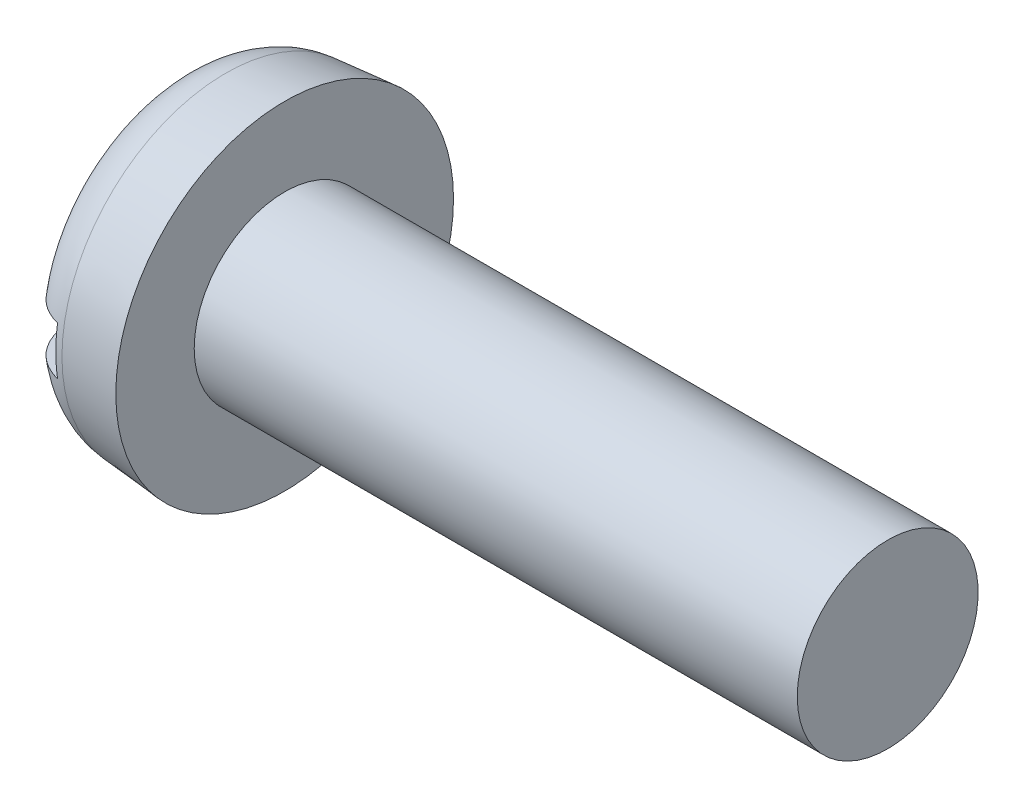
ISO-10303-21;
HEADER;
FILE_DESCRIPTION(('STEP AP214'),'2;1');
FILE_NAME('part.step','',(''),(''),'','','');
FILE_SCHEMA(('AUTOMOTIVE_DESIGN { 1 0 10303 214 1 1 1 1 }'));
ENDSEC;
DATA;
#1=APPLICATION_CONTEXT('core data for automotive mechanical design processes');
#2=APPLICATION_PROTOCOL_DEFINITION('international standard','automotive_design',2000,#1);
#3=PRODUCT_CONTEXT('',#1,'mechanical');
#4=PRODUCT('Part','Part','',(#3));
#5=PRODUCT_RELATED_PRODUCT_CATEGORY('part','',(#4));
#6=PRODUCT_DEFINITION_FORMATION('','',#4);
#7=PRODUCT_DEFINITION_CONTEXT('part definition',#1,'design');
#8=PRODUCT_DEFINITION('design','',#6,#7);
#9=PRODUCT_DEFINITION_SHAPE('','',#8);
#10=(LENGTH_UNIT() NAMED_UNIT(*) SI_UNIT(.MILLI.,.METRE.));
#11=(NAMED_UNIT(*) PLANE_ANGLE_UNIT() SI_UNIT($,.RADIAN.));
#12=(NAMED_UNIT(*) SI_UNIT($,.STERADIAN.) SOLID_ANGLE_UNIT());
#13=UNCERTAINTY_MEASURE_WITH_UNIT(LENGTH_MEASURE(1.E-05),#10,'distance_accuracy_value','');
#14=(GEOMETRIC_REPRESENTATION_CONTEXT(3) GLOBAL_UNCERTAINTY_ASSIGNED_CONTEXT((#13)) GLOBAL_UNIT_ASSIGNED_CONTEXT((#10,
#11,#12)) REPRESENTATION_CONTEXT('',''));
#15=CARTESIAN_POINT('',(0.,0.,0.));
#16=DIRECTION('',(0.,0.,1.));
#17=DIRECTION('',(1.,0.,0.));
#18=AXIS2_PLACEMENT_3D('',#15,#16,#17);
#19=CARTESIAN_POINT('',(0.,0.,0.));
#20=DIRECTION('',(-1.,0.,0.));
#21=DIRECTION('',(0.,0.,1.));
#22=AXIS2_PLACEMENT_3D('',#19,#20,#21);
#23=PLANE('',#22);
#24=DIRECTION('',(0.,0.,-1.));
#25=VECTOR('',#24,1.);
#26=CARTESIAN_POINT('',(0.,0.399999999999999,2.8));
#27=LINE('',#26,#25);
#28=CARTESIAN_POINT('',(0.,0.399999999999999,1.77326763142532));
#29=VERTEX_POINT('',#28);
#30=CARTESIAN_POINT('',(0.,0.399999999999999,-1.77326763142532));
#31=VERTEX_POINT('',#30);
#32=EDGE_CURVE('E85',#29,#31,#27,.T.);
#33=ORIENTED_EDGE('',*,*,#32,.F.);
#34=CARTESIAN_POINT('',(0.,0.,0.));
#35=DIRECTION('',(-1.,0.,0.));
#36=DIRECTION('',(0.,0.,1.));
#37=AXIS2_PLACEMENT_3D('',#34,#35,#36);
#38=CIRCLE('',#37,1.81782234903766);
#39=EDGE_CURVE('E91',#29,#31,#38,.T.);
#40=ORIENTED_EDGE('',*,*,#39,.T.);
#41=EDGE_LOOP('',(#33,#40));
#42=FACE_BOUND('',#41,.T.);
#43=ADVANCED_FACE('F32',(#42),#23,.T.);
#44=CARTESIAN_POINT('',(-25.4,0.,0.));
#45=DIRECTION('',(-1.,0.,0.));
#46=DIRECTION('',(0.,0.,1.));
#47=AXIS2_PLACEMENT_3D('',#44,#45,#46);
#48=CYLINDRICAL_SURFACE('',#47,1.5);
#49=CARTESIAN_POINT('',(11.8,0.,0.));
#50=DIRECTION('',(-1.,0.,0.));
#51=DIRECTION('',(0.,0.,1.));
#52=AXIS2_PLACEMENT_3D('',#49,#50,#51);
#53=CIRCLE('',#52,1.5);
#54=CARTESIAN_POINT('',(11.8,0.,1.5));
#55=VERTEX_POINT('',#54);
#56=EDGE_CURVE('E92',#55,#55,#53,.T.);
#57=ORIENTED_EDGE('',*,*,#56,.T.);
#58=EDGE_LOOP('',(#57));
#59=FACE_BOUND('',#58,.T.);
#60=CARTESIAN_POINT('',(1.8,0.,0.));
#61=DIRECTION('',(-1.,0.,0.));
#62=DIRECTION('',(0.,0.,1.));
#63=AXIS2_PLACEMENT_3D('',#60,#61,#62);
#64=CIRCLE('',#63,1.5);
#65=CARTESIAN_POINT('',(1.8,0.,1.5));
#66=VERTEX_POINT('',#65);
#67=EDGE_CURVE('E149',#66,#66,#64,.T.);
#68=ORIENTED_EDGE('',*,*,#67,.F.);
#69=EDGE_LOOP('',(#68));
#70=FACE_BOUND('',#69,.T.);
#71=ADVANCED_FACE('F137',(#59,#70),#48,.T.);
#72=CARTESIAN_POINT('',(11.8,1.5,0.));
#73=DIRECTION('',(1.,0.,0.));
#74=DIRECTION('',(0.,0.,-1.));
#75=AXIS2_PLACEMENT_3D('',#72,#73,#74);
#76=PLANE('',#75);
#77=ORIENTED_EDGE('',*,*,#56,.F.);
#78=EDGE_LOOP('',(#77));
#79=FACE_BOUND('',#78,.T.);
#80=ADVANCED_FACE('F135',(#79),#76,.T.);
#81=DIRECTION('',(0.,0.,1.));
#82=VECTOR('',#81,1.);
#83=CARTESIAN_POINT('',(0.,-0.4,-2.8));
#84=LINE('',#83,#82);
#85=CARTESIAN_POINT('',(0.,-0.4,-1.77326763142532));
#86=VERTEX_POINT('',#85);
#87=CARTESIAN_POINT('',(0.,-0.4,1.77326763142532));
#88=VERTEX_POINT('',#87);
#89=EDGE_CURVE('E76',#86,#88,#84,.T.);
#90=ORIENTED_EDGE('',*,*,#89,.F.);
#91=EDGE_CURVE('E83',#86,#88,#38,.T.);
#92=ORIENTED_EDGE('',*,*,#91,.T.);
#93=EDGE_LOOP('',(#90,#92));
#94=FACE_BOUND('',#93,.T.);
#95=ADVANCED_FACE('F82',(#94),#23,.T.);
#96=CARTESIAN_POINT('',(0.,0.,0.));
#97=DIRECTION('',(1.,0.,0.));
#98=DIRECTION('',(0.,0.,-1.));
#99=AXIS2_PLACEMENT_3D('',#96,#97,#98);
#100=CONICAL_SURFACE('',#99,2.64252040565334,0.087266462599717);
#101=CARTESIAN_POINT('',(0.821559831527107,0.,0.));
#102=DIRECTION('',(-1.,0.,0.));
#103=DIRECTION('',(0.,0.,1.));
#104=AXIS2_PLACEMENT_3D('',#101,#102,#103);
#105=CIRCLE('',#104,2.71439757732023);
#106=CARTESIAN_POINT('',(0.821559831527107,0.,2.71439757732023));
#107=VERTEX_POINT('',#106);
#108=EDGE_CURVE('E95',#107,#107,#105,.F.);
#109=ORIENTED_EDGE('',*,*,#108,.T.);
#110=EDGE_LOOP('',(#109));
#111=FACE_BOUND('',#110,.T.);
#112=CARTESIAN_POINT('',(1.8,0.,0.));
#113=DIRECTION('',(-1.,0.,0.));
#114=DIRECTION('',(0.,0.,1.));
#115=AXIS2_PLACEMENT_3D('',#112,#113,#114);
#116=CIRCLE('',#115,2.8);
#117=CARTESIAN_POINT('',(1.8,0.,2.8));
#118=VERTEX_POINT('',#117);
#119=EDGE_CURVE('E97',#118,#118,#116,.T.);
#120=ORIENTED_EDGE('',*,*,#119,.T.);
#121=EDGE_LOOP('',(#120));
#122=FACE_BOUND('',#121,.T.);
#123=ADVANCED_FACE('F128',(#111,#122),#100,.T.);
#124=CARTESIAN_POINT('',(1.8,1.5,0.));
#125=DIRECTION('',(-1.,0.,0.));
#126=DIRECTION('',(0.,0.,1.));
#127=AXIS2_PLACEMENT_3D('',#124,#125,#126);
#128=PLANE('',#127);
#129=ORIENTED_EDGE('',*,*,#119,.F.);
#130=EDGE_LOOP('',(#129));
#131=FACE_BOUND('',#130,.T.);
#132=ORIENTED_EDGE('',*,*,#67,.T.);
#133=EDGE_LOOP('',(#132));
#134=FACE_BOUND('',#133,.T.);
#135=ADVANCED_FACE('F124',(#131,#134),#128,.F.);
#136=CARTESIAN_POINT('',(0.9,0.,0.));
#137=DIRECTION('',(-1.,0.,0.));
#138=DIRECTION('',(0.,0.,1.));
#139=AXIS2_PLACEMENT_3D('',#136,#137,#138);
#140=TOROIDAL_SURFACE('',#139,1.81782234903766,0.9);
#141=CARTESIAN_POINT('',(0.285780762477817,0.399999999999999,-2.44311963508101));
#142=CARTESIAN_POINT('',(0.322325244969282,0.399999999999999,-2.47769297217772));
#143=CARTESIAN_POINT('',(0.361794878156767,0.399999999999999,-2.50922544126929));
#144=CARTESIAN_POINT('',(0.445493757535042,0.399999999999999,-2.56525291577746));
#145=CARTESIAN_POINT('',(0.48972822484029,0.399999999999999,-2.58974009118149));
#146=CARTESIAN_POINT('',(0.581685294636184,0.399999999999999,-2.63091846199156));
#147=CARTESIAN_POINT('',(0.629407305379897,0.399999999999999,-2.64761097641683));
#148=CARTESIAN_POINT('',(0.726972312257168,0.399999999999999,-2.67270033258514));
#149=CARTESIAN_POINT('',(0.776814803129367,0.399999999999999,-2.68109913910669));
#150=CARTESIAN_POINT('',(0.876977038697278,0.399999999999999,-2.68933922206438));
#151=CARTESIAN_POINT('',(0.92729364560996,0.399999999999999,-2.68921866149007));
#152=CARTESIAN_POINT('',(1.02719093347253,0.399999999999999,-2.68051830929739));
#153=CARTESIAN_POINT('',(1.07677160162593,0.399999999999999,-2.67193837076201));
#154=CARTESIAN_POINT('',(1.17371760664879,0.399999999999999,-2.6465919807109));
#155=CARTESIAN_POINT('',(1.2210859954371,0.399999999999999,-2.62983719558013));
#156=CARTESIAN_POINT('',(1.31235127069059,0.399999999999999,-2.58864040768255));
#157=CARTESIAN_POINT('',(1.35624813968071,0.399999999999999,-2.56419836622246));
#158=CARTESIAN_POINT('',(1.43950339303332,0.399999999999999,-2.50824069345436));
#159=CARTESIAN_POINT('',(1.47884484993389,0.399999999999999,-2.47669988555644));
#160=CARTESIAN_POINT('',(1.55173067508121,0.399999999999999,-2.40751412200212));
#161=CARTESIAN_POINT('',(1.5852748745774,0.399999999999999,-2.36986898871862));
#162=CARTESIAN_POINT('',(1.64594872274809,0.399999999999999,-2.28919528368316));
#163=CARTESIAN_POINT('',(1.67301846569636,0.399999999999999,-2.24612167422176));
#164=CARTESIAN_POINT('',(1.71966197411636,0.399999999999999,-2.15609376898817));
#165=CARTESIAN_POINT('',(1.73923530584546,0.399999999999999,-2.10913924885738));
#166=CARTESIAN_POINT('',(1.77066025907209,0.399999999999999,-2.01194193646076));
#167=CARTESIAN_POINT('',(1.78239254664628,0.399999999999999,-1.96166058810882));
#168=CARTESIAN_POINT('',(1.7974373595853,0.399999999999999,-1.85985639013623));
#169=CARTESIAN_POINT('',(1.80074908437145,0.399999999999999,-1.80833342293966));
#170=CARTESIAN_POINT('',(1.79894832980293,0.399999999999999,-1.70434405475568));
#171=CARTESIAN_POINT('',(1.79365584590562,0.399999999999999,-1.651880798299));
#172=CARTESIAN_POINT('',(1.77456092354076,0.399999999999999,-1.54852841034414));
#173=CARTESIAN_POINT('',(1.76075741543224,0.399999999999999,-1.49763947754675));
#174=CARTESIAN_POINT('',(1.7246504916629,0.399999999999999,-1.3975266769579));
#175=CARTESIAN_POINT('',(1.70214283236717,0.399999999999999,-1.34837644263265));
#176=CARTESIAN_POINT('',(1.64933120824444,0.399999999999999,-1.25444995564252));
#177=CARTESIAN_POINT('',(1.6190255468442,0.399999999999999,-1.20967465773975));
#178=CARTESIAN_POINT('',(1.55085214424215,0.399999999999999,-1.12504927254803));
#179=CARTESIAN_POINT('',(1.51286662510254,0.399999999999999,-1.08529386793689));
#180=CARTESIAN_POINT('',(1.4306134165613,0.399999999999999,-1.01288372669285));
#181=CARTESIAN_POINT('',(1.38634513970435,0.399999999999999,-0.980229654778111));
#182=CARTESIAN_POINT('',(1.29378824575784,0.399999999999999,-0.924048107397016));
#183=CARTESIAN_POINT('',(1.24562231583718,0.399999999999999,-0.900319541839471));
#184=CARTESIAN_POINT('',(1.14574424072186,0.399999999999999,-0.862177327128566));
#185=CARTESIAN_POINT('',(1.09403573066562,0.399999999999999,-0.847754283110135));
#186=CARTESIAN_POINT('',(0.993395643106034,0.399999999999999,-0.830011922353259));
#187=CARTESIAN_POINT('',(0.944615271160062,0.399999999999999,-0.825833796085957));
#188=CARTESIAN_POINT('',(0.847107354416666,0.399999999999999,-0.826334878356685));
#189=CARTESIAN_POINT('',(0.798379798268946,0.399999999999999,-0.831011470142969));
#190=CARTESIAN_POINT('',(0.705495670608723,0.399999999999999,-0.848340731069384));
#191=CARTESIAN_POINT('',(0.661242330843084,0.399999999999999,-0.860484898174224));
#192=CARTESIAN_POINT('',(0.575232402842408,0.399999999999999,-0.891650416332973));
#193=CARTESIAN_POINT('',(0.53347652813922,0.399999999999999,-0.910673721938904));
#194=CARTESIAN_POINT('',(0.451191926076945,0.399999999999999,-0.956010770911779));
#195=CARTESIAN_POINT('',(0.410848958567061,0.399999999999999,-0.982660648611481));
#196=CARTESIAN_POINT('',(0.334722321142852,0.399999999999999,-1.04182188589593));
#197=CARTESIAN_POINT('',(0.298940164912518,0.399999999999999,-1.0743351828853));
#198=CARTESIAN_POINT('',(0.229649980616187,0.399999999999999,-1.14749226888793));
#199=CARTESIAN_POINT('',(0.19663491483028,0.399999999999999,-1.18860403936715));
#200=CARTESIAN_POINT('',(0.137645150810003,0.399999999999999,-1.27560624817727));
#201=CARTESIAN_POINT('',(0.111672172806046,0.399999999999999,-1.32149785033543));
#202=CARTESIAN_POINT('',(0.0665593590158845,0.399999999999999,-1.41881690272049));
#203=CARTESIAN_POINT('',(0.0477401615322295,0.399999999999999,-1.47039354331754));
#204=CARTESIAN_POINT('',(0.0191028447664949,0.399999999999999,-1.57598967955257));
#205=CARTESIAN_POINT('',(0.0092842991143383,0.399999999999999,-1.63000905934828));
#206=CARTESIAN_POINT('',(-0.000908845669418229,0.399999999999999,-1.73850050809585));
#207=CARTESIAN_POINT('',(-0.00135843890630432,0.399999999999999,-1.7929654882335));
#208=CARTESIAN_POINT('',(0.00713794868793661,0.399999999999999,-1.90117587148683));
#209=CARTESIAN_POINT('',(0.0160852351491477,0.399999999999999,-1.9549211735574));
#210=CARTESIAN_POINT('',(0.0428869469078851,0.399999999999999,-2.05874477252473));
#211=CARTESIAN_POINT('',(0.0605196216319729,0.399999999999999,-2.10888044427302));
#212=CARTESIAN_POINT('',(0.104140493725079,0.399999999999999,-2.20532358851202));
#213=CARTESIAN_POINT('',(0.130117020588857,0.399999999999999,-2.25163629510255));
#214=CARTESIAN_POINT('',(0.178150945787741,0.399999999999999,-2.32211375046635));
#215=CARTESIAN_POINT('',(0.197843641859489,0.399999999999999,-2.34792122195273));
#216=CARTESIAN_POINT('',(0.239879292580621,0.399999999999999,-2.39728022756983));
#217=CARTESIAN_POINT('',(0.26222221206527,0.399999999999999,-2.42083179162577));
#218=CARTESIAN_POINT('',(0.285780762477817,0.399999999999999,-2.44311963508101));
#219=B_SPLINE_CURVE_WITH_KNOTS('',3,(#141,#142,#143,#144,#145,#146,#147,#148,#149,#150,#151,
#152,#153,#154,#155,#156,#157,#158,#159,#160,#161,#162,#163,#164,#165,#166,#167,#168,#169,#170,
#171,#172,#173,#174,#175,#176,#177,#178,#179,#180,#181,#182,#183,#184,#185,#186,#187,#188,#189,
#190,#191,#192,#193,#194,#195,#196,#197,#198,#199,#200,#201,#202,#203,#204,#205,#206,#207,#208,
#209,#210,#211,#212,#213,#214,#215,#216,#217,#218),.UNSPECIFIED.,.T.,.F.,(4,2,2,2,2,2,2,2,2,2,2,
2,2,2,2,2,2,2,2,2,2,2,2,2,2,2,2,2,2,2,2,2,2,2,2,2,2,2,4),(0.,0.15080428220943,0.301775523831159,
0.452721208703323,0.603631125974155,0.753865076726384,0.904101636690626,1.05412441728995,
1.2041479530309,1.35471219197995,1.50528081291863,1.65719291262943,1.80911380065295,
1.96329712022902,2.11749509812026,2.27496068670365,2.43244606914274,2.59387611122166,
2.75534130458713,2.9195015653164,3.08367718561128,3.24389389244898,3.40394859014677,
3.55004213794101,3.69609251881818,3.83315592967566,3.97025831464733,4.11470991133513,
4.25920932580005,4.41668805635775,4.57420522099047,4.73812462607052,4.90203626571949,
5.06463536051201,5.22725705028985,5.38592661841767,5.54437521558828,5.64159310397338,
5.73880970255809),.UNSPECIFIED.);
#220=CARTESIAN_POINT('',(0.7,0.399999999999999,-2.66547244738019));
#221=VERTEX_POINT('',#220);
#222=EDGE_CURVE('E11',#31,#221,#219,.T.);
#223=ORIENTED_EDGE('',*,*,#222,.F.);
#224=ORIENTED_EDGE('',*,*,#39,.F.);
#225=CARTESIAN_POINT('',(0.356169071138296,0.399999999999999,1.02545886384317));
#226=CARTESIAN_POINT('',(0.394477383289829,0.399999999999999,0.994276095963573));
#227=CARTESIAN_POINT('',(0.435252098816795,0.399999999999999,0.966090537778846));
#228=CARTESIAN_POINT('',(0.520874070068605,0.399999999999999,0.916713010685472));
#229=CARTESIAN_POINT('',(0.56572297498939,0.399999999999999,0.895523890103122));
#230=CARTESIAN_POINT('',(0.658585145836014,0.399999999999999,0.861072215462475));
#231=CARTESIAN_POINT('',(0.706609437889925,0.399999999999999,0.84783908573147));
#232=CARTESIAN_POINT('',(0.80424325350734,0.399999999999999,0.83024223356215));
#233=CARTESIAN_POINT('',(0.853851628876229,0.399999999999999,0.825872228699233));
#234=CARTESIAN_POINT('',(0.950010182321422,0.399999999999999,0.826277197704913));
#235=CARTESIAN_POINT('',(0.99656347412262,0.399999999999999,0.830513937244102));
#236=CARTESIAN_POINT('',(1.08828168676608,0.399999999999999,0.846797595491545));
#237=CARTESIAN_POINT('',(1.1334463088223,0.399999999999999,0.858846182848628));
#238=CARTESIAN_POINT('',(1.22099947575276,0.399999999999999,0.890027753500388));
#239=CARTESIAN_POINT('',(1.26339999097867,0.399999999999999,0.909127417221132));
#240=CARTESIAN_POINT('',(1.34475562295769,0.399999999999999,0.953613660794996));
#241=CARTESIAN_POINT('',(1.38370973618203,0.399999999999999,0.979002063689565));
#242=CARTESIAN_POINT('',(1.4606297229717,0.399999999999999,1.03768873851847));
#243=CARTESIAN_POINT('',(1.49821861120609,0.399999999999999,1.07148126912978));
#244=CARTESIAN_POINT('',(1.56766557552966,0.399999999999999,1.14451739265722));
#245=CARTESIAN_POINT('',(1.59952174981566,0.399999999999999,1.18376278691406));
#246=CARTESIAN_POINT('',(1.65882951195037,0.399999999999999,1.26965174466254));
#247=CARTESIAN_POINT('',(1.68580874421987,0.399999999999999,1.3166225459502));
#248=CARTESIAN_POINT('',(1.7316261790846,0.399999999999999,1.41438438512647));
#249=CARTESIAN_POINT('',(1.7504634598458,0.399999999999999,1.46517585482832));
#250=CARTESIAN_POINT('',(1.77959171793735,0.399999999999999,1.56990546726));
#251=CARTESIAN_POINT('',(1.78976336496765,0.399999999999999,1.62387693551388));
#252=CARTESIAN_POINT('',(1.80070617985939,0.399999999999999,1.73276786407042));
#253=CARTESIAN_POINT('',(1.80147810121521,0.399999999999999,1.78768724803349));
#254=CARTESIAN_POINT('',(1.7935515731225,0.399999999999999,1.89576039323533));
#255=CARTESIAN_POINT('',(1.78503812714098,0.399999999999999,1.94892767588158));
#256=CARTESIAN_POINT('',(1.75897009134329,0.399999999999999,2.05299963181349));
#257=CARTESIAN_POINT('',(1.74141670948687,0.399999999999999,2.10390460641263));
#258=CARTESIAN_POINT('',(1.69825810143573,0.399999999999999,2.20064023444731));
#259=CARTESIAN_POINT('',(1.67286703477487,0.399999999999999,2.24656646381803));
#260=CARTESIAN_POINT('',(1.61458416704904,0.399999999999999,2.33338474929434));
#261=CARTESIAN_POINT('',(1.58169323312494,0.399999999999999,2.37427738654701));
#262=CARTESIAN_POINT('',(1.51007060998367,0.399999999999999,2.44900649357427));
#263=CARTESIAN_POINT('',(1.47146964140907,0.399999999999999,2.48296829636122));
#264=CARTESIAN_POINT('',(1.38904817001727,0.399999999999999,2.54382334084698));
#265=CARTESIAN_POINT('',(1.34522808158393,0.399999999999999,2.57071714318276));
#266=CARTESIAN_POINT('',(1.25424836231413,0.399999999999999,2.61630908807752));
#267=CARTESIAN_POINT('',(1.20714119293126,0.399999999999999,2.63511196373395));
#268=CARTESIAN_POINT('',(1.11042474691739,0.399999999999999,2.66447616047847));
#269=CARTESIAN_POINT('',(1.06081558875378,0.399999999999999,2.67503787139057));
#270=CARTESIAN_POINT('',(0.960893961973373,0.399999999999999,2.68755622717405));
#271=CARTESIAN_POINT('',(0.910589316471373,0.399999999999999,2.68957539390776));
#272=CARTESIAN_POINT('',(0.810358152757913,0.399999999999999,2.68512046084422));
#273=CARTESIAN_POINT('',(0.760431626986743,0.399999999999999,2.67864653130185));
#274=CARTESIAN_POINT('',(0.662478823238217,0.399999999999999,2.65741995217084));
#275=CARTESIAN_POINT('',(0.614448868329621,0.399999999999999,2.64268425826029));
#276=CARTESIAN_POINT('',(0.521534433162197,0.399999999999999,2.60538142887937));
#277=CARTESIAN_POINT('',(0.476649962619439,0.399999999999999,2.58281426921971));
#278=CARTESIAN_POINT('',(0.391148993047609,0.399999999999999,2.53043182461717));
#279=CARTESIAN_POINT('',(0.350545548527357,0.399999999999999,2.50059523892845));
#280=CARTESIAN_POINT('',(0.274874117650141,0.399999999999999,2.43457977439371));
#281=CARTESIAN_POINT('',(0.239806285839746,0.399999999999999,2.39840071853429));
#282=CARTESIAN_POINT('',(0.1758792791862,0.399999999999999,2.32042102737606));
#283=CARTESIAN_POINT('',(0.147073507775005,0.399999999999999,2.27857662814835));
#284=CARTESIAN_POINT('',(0.0967847753411475,0.399999999999999,2.19069995841567));
#285=CARTESIAN_POINT('',(0.07530224160311,0.399999999999999,2.14466744374764));
#286=CARTESIAN_POINT('',(0.0399276675747797,0.399999999999999,2.04903409979779));
#287=CARTESIAN_POINT('',(0.0261471165350435,0.399999999999999,1.99939205575588));
#288=CARTESIAN_POINT('',(0.00693602242391585,0.399999999999999,1.89852251200784));
#289=CARTESIAN_POINT('',(0.00150590448368245,0.399999999999999,1.84729493171548));
#290=CARTESIAN_POINT('',(-0.000985777473936878,0.399999999999999,1.74359522844075));
#291=CARTESIAN_POINT('',(0.0021251999996528,0.399999999999999,1.69111899279254));
#292=CARTESIAN_POINT('',(0.0168916821616579,0.399999999999999,1.58737297380086));
#293=CARTESIAN_POINT('',(0.0285499964789278,0.399999999999999,1.53610359288829));
#294=CARTESIAN_POINT('',(0.0604020950384819,0.399999999999999,1.43486374575567));
#295=CARTESIAN_POINT('',(0.080804315905155,0.399999999999999,1.38495893538538));
#296=CARTESIAN_POINT('',(0.129530825890043,0.399999999999999,1.28921347783136));
#297=CARTESIAN_POINT('',(0.157849403934621,0.399999999999999,1.24336993202389));
#298=CARTESIAN_POINT('',(0.213684916145749,0.399999999999999,1.16773658539622));
#299=CARTESIAN_POINT('',(0.239651023875377,0.399999999999999,1.13678903007943));
#300=CARTESIAN_POINT('',(0.29525297901351,0.399999999999999,1.07838116842152));
#301=CARTESIAN_POINT('',(0.324888803246328,0.399999999999999,1.05092084005941));
#302=CARTESIAN_POINT('',(0.356169071138296,0.399999999999999,1.02545886384317));
#303=B_SPLINE_CURVE_WITH_KNOTS('',3,(#225,#226,#227,#228,#229,#230,#231,#232,#233,#234,#235,
#236,#237,#238,#239,#240,#241,#242,#243,#244,#245,#246,#247,#248,#249,#250,#251,#252,#253,#254,
#255,#256,#257,#258,#259,#260,#261,#262,#263,#264,#265,#266,#267,#268,#269,#270,#271,#272,#273,
#274,#275,#276,#277,#278,#279,#280,#281,#282,#283,#284,#285,#286,#287,#288,#289,#290,#291,#292,
#293,#294,#295,#296,#297,#298,#299,#300,#301,#302),.UNSPECIFIED.,.T.,.F.,(4,2,2,2,2,2,2,2,2,2,2,
2,2,2,2,2,2,2,2,2,2,2,2,2,2,2,2,2,2,2,2,2,2,2,2,2,2,2,4),(0.,0.148056677712979,
0.296173556814866,0.444834912477076,0.593390856036848,0.732942639414739,0.87252424155987,
1.01145452751666,1.15042513517956,1.30141738715291,1.45245963818336,1.61420969223844,
1.7759780548859,1.93993961693164,2.10388803551639,2.26462860972824,2.42534771058163,
2.58201478455569,2.73866375372932,2.89216335268838,3.04565077231286,3.19708679229202,
3.34851564860216,3.49883427697698,3.64914989207022,3.79915813668078,3.94916684463061,
4.09962050651671,4.25007836811616,4.40177296660437,4.55347641441351,4.70732244078731,
4.86117629939849,5.0181609530014,5.17519723279955,5.33620557401864,5.49709805791682,
5.61799301592463,5.73888721047272),.UNSPECIFIED.);
#304=CARTESIAN_POINT('',(0.7,0.399999999999999,2.66547244738019));
#305=VERTEX_POINT('',#304);
#306=EDGE_CURVE('E109',#305,#29,#303,.T.);
#307=ORIENTED_EDGE('',*,*,#306,.F.);
#308=CARTESIAN_POINT('',(0.7,0.,0.));
#309=DIRECTION('',(-1.,0.,0.));
#310=DIRECTION('',(0.,0.,1.));
#311=AXIS2_PLACEMENT_3D('',#308,#309,#310);
#312=CIRCLE('',#311,2.69531878777687);
#313=CARTESIAN_POINT('',(0.7,-0.4,2.66547244738019));
#314=VERTEX_POINT('',#313);
#315=EDGE_CURVE('E103',#305,#314,#312,.F.);
#316=ORIENTED_EDGE('',*,*,#315,.T.);
#317=CARTESIAN_POINT('',(0.356169071138295,-0.4,1.02545886384317));
#318=CARTESIAN_POINT('',(0.314031332279046,-0.4,1.05976167261355));
#319=CARTESIAN_POINT('',(0.274819372687131,-0.4,1.0977427449374));
#320=CARTESIAN_POINT('',(0.20326819432942,-0.4,1.17978565669674));
#321=CARTESIAN_POINT('',(0.170942545508555,-0.4,1.22385922524595));
#322=CARTESIAN_POINT('',(0.114111407238762,-0.4,1.31672727393884));
#323=CARTESIAN_POINT('',(0.0895968760226379,-0.4,1.36551620987613));
#324=CARTESIAN_POINT('',(0.0490785202121342,-0.4,1.46648183341045));
#325=CARTESIAN_POINT('',(0.0330703604686471,-0.4,1.51865678013273));
#326=CARTESIAN_POINT('',(0.0100453697545739,-0.4,1.62518908376032));
#327=CARTESIAN_POINT('',(0.00306618218707072,-0.4,1.67955460937645));
#328=CARTESIAN_POINT('',(-0.00144685561490153,-0.4,1.78868546318226));
#329=CARTESIAN_POINT('',(0.00101939609011318,-0.4,1.84345079568049));
#330=CARTESIAN_POINT('',(0.0152891480749748,-0.4,1.95052330416009));
#331=CARTESIAN_POINT('',(0.0268854930795697,-0.4,2.0028580557661));
#332=CARTESIAN_POINT('',(0.0589248901673074,-0.4,2.10474672243029));
#333=CARTESIAN_POINT('',(0.0793666318053631,-0.4,2.15430104818042));
#334=CARTESIAN_POINT('',(0.12795627217374,-0.4,2.24792186385266));
#335=CARTESIAN_POINT('',(0.155901237504733,-0.4,2.29209371256844));
#336=CARTESIAN_POINT('',(0.218944857951456,-0.4,2.37499861286517));
#337=CARTESIAN_POINT('',(0.254042725445854,-0.4,2.41373226246544));
#338=CARTESIAN_POINT('',(0.32966685096813,-0.4,2.48389534278566));
#339=CARTESIAN_POINT('',(0.370077637452012,-0.4,2.51544927894014));
#340=CARTESIAN_POINT('',(0.455677448683675,-0.4,2.57122459505542));
#341=CARTESIAN_POINT('',(0.500866128165061,-0.4,2.59544650436481));
#342=CARTESIAN_POINT('',(0.59413782417454,-0.4,2.6355729416184));
#343=CARTESIAN_POINT('',(0.642178527071038,-0.4,2.65157587103637));
#344=CARTESIAN_POINT('',(0.740273420359947,-0.4,2.67523109383666));
#345=CARTESIAN_POINT('',(0.790327524333046,-0.4,2.68288374523438));
#346=CARTESIAN_POINT('',(0.890686133385994,-0.4,2.68958762962226));
#347=CARTESIAN_POINT('',(0.940986998851127,-0.4,2.68869347246838));
#348=CARTESIAN_POINT('',(1.04072178380744,-0.4,2.67846167879018));
#349=CARTESIAN_POINT('',(1.0901557170213,-0.4,2.66912417603886));
#350=CARTESIAN_POINT('',(1.18669599164727,-0.4,2.64229877559468));
#351=CARTESIAN_POINT('',(1.23380501833184,-0.4,2.6248205362643));
#352=CARTESIAN_POINT('',(1.32443528846507,-0.4,2.58223220159563));
#353=CARTESIAN_POINT('',(1.36795650500275,-0.4,2.5571220490195));
#354=CARTESIAN_POINT('',(1.45036421793263,-0.4,2.49989362614525));
#355=CARTESIAN_POINT('',(1.48923230512215,-0.4,2.46774885590998));
#356=CARTESIAN_POINT('',(1.56107927302393,-0.4,2.39744378923729));
#357=CARTESIAN_POINT('',(1.59405796507024,-0.4,2.35928330016087));
#358=CARTESIAN_POINT('',(1.65352847250663,-0.4,2.2776666814067));
#359=CARTESIAN_POINT('',(1.67995797143492,-0.4,2.23416516156708));
#360=CARTESIAN_POINT('',(1.72526137908633,-0.4,2.14339421504174));
#361=CARTESIAN_POINT('',(1.74413484906926,-0.4,2.09612456975119));
#362=CARTESIAN_POINT('',(1.77411508290512,-0.4,1.9983989612356));
#363=CARTESIAN_POINT('',(1.78509960932637,-0.4,1.9479055243096));
#364=CARTESIAN_POINT('',(1.79862667184961,-0.4,1.84580292273346));
#365=CARTESIAN_POINT('',(1.80116838107033,-0.4,1.79419364929756));
#366=CARTESIAN_POINT('',(1.79780993826834,-0.4,1.69014314952536));
#367=CARTESIAN_POINT('',(1.79172746900389,-0.4,1.63770783465182));
#368=CARTESIAN_POINT('',(1.77106806778027,-0.4,1.53454005861514));
#369=CARTESIAN_POINT('',(1.75649007103968,-0.4,1.48380781174802));
#370=CARTESIAN_POINT('',(1.7188487103298,-0.4,1.38413781596447));
#371=CARTESIAN_POINT('',(1.69558194660123,-0.4,1.33527684770509));
#372=CARTESIAN_POINT('',(1.64130257902653,-0.4,1.24205401456033));
#373=CARTESIAN_POINT('',(1.6102882125599,-0.4,1.19769317671197));
#374=CARTESIAN_POINT('',(1.54078360718032,-0.4,1.11407031283595));
#375=CARTESIAN_POINT('',(1.50218355419827,-0.4,1.07489936013486));
#376=CARTESIAN_POINT('',(1.418793823597,-0.4,1.00377929202409));
#377=CARTESIAN_POINT('',(1.37400377230517,-0.4,0.971830612909673));
#378=CARTESIAN_POINT('',(1.28066227969846,-0.4,0.917245549760186));
#379=CARTESIAN_POINT('',(1.23224470963451,-0.4,0.894381439836963));
#380=CARTESIAN_POINT('',(1.13202516716603,-0.4,0.858023892867301));
#381=CARTESIAN_POINT('',(1.08022692076976,-0.4,0.844520323748755));
#382=CARTESIAN_POINT('',(0.979686768939645,-0.4,0.828554710074538));
#383=CARTESIAN_POINT('',(0.93108358272059,-0.4,0.82521631591368));
#384=CARTESIAN_POINT('',(0.834057576527117,-0.4,0.827306267768066));
#385=CARTESIAN_POINT('',(0.785634764475607,-0.4,0.832734994430688));
#386=CARTESIAN_POINT('',(0.693219129123407,-0.4,0.851440182721389));
#387=CARTESIAN_POINT('',(0.6491307615266,-0.4,0.864254528165209));
#388=CARTESIAN_POINT('',(0.563580966367806,-0.4,0.896690334746237));
#389=CARTESIAN_POINT('',(0.522117110679347,-0.4,0.916305391888431));
#390=CARTESIAN_POINT('',(0.460201335026828,-0.4,0.951554535089635));
#391=CARTESIAN_POINT('',(0.438547037771903,-0.4,0.965129512636783));
#392=CARTESIAN_POINT('',(0.396436028831445,-0.4,0.994018383793285));
#393=CARTESIAN_POINT('',(0.375979221006585,-0.4,1.00933213751563));
#394=CARTESIAN_POINT('',(0.356169071138295,-0.4,1.02545886384317));
#395=B_SPLINE_CURVE_WITH_KNOTS('',3,(#317,#318,#319,#320,#321,#322,#323,#324,#325,#326,#327,
#328,#329,#330,#331,#332,#333,#334,#335,#336,#337,#338,#339,#340,#341,#342,#343,#344,#345,#346,
#347,#348,#349,#350,#351,#352,#353,#354,#355,#356,#357,#358,#359,#360,#361,#362,#363,#364,#365,
#366,#367,#368,#369,#370,#371,#372,#373,#374,#375,#376,#377,#378,#379,#380,#381,#382,#383,#384,
#385,#386,#387,#388,#389,#390,#391,#392,#393,#394),.UNSPECIFIED.,.T.,.F.,(4,2,2,2,2,2,2,2,2,2,2,
2,2,2,2,2,2,2,2,2,2,2,2,2,2,2,2,2,2,2,2,2,2,2,2,2,2,2,4),(0.,0.162908543977831,
0.326135200101453,0.489172220791498,0.652126072139756,0.815757140806174,0.979389975458609,
1.13941349616251,1.29941331750199,1.45545894016543,1.61148738958683,1.76455910424509,
1.91761976498379,2.068802492645,2.21997873814259,2.37018969158947,2.52039826519579,
2.67042907998157,2.82046101999671,2.97106818075077,3.12168016531919,3.27367450756494,
3.42567767407005,3.5799880622519,3.73431356299688,3.89195060675763,4.04960741210517,
4.2112132976058,4.37285598283535,4.53703863620331,4.70123120514445,4.86099956435944,
5.02059471531597,5.16597452097209,5.31136063884072,5.44850857150574,5.58552770590542,
5.66212180496716,5.73870974628516),.UNSPECIFIED.);
#396=EDGE_CURVE('E90',#88,#314,#395,.T.);
#397=ORIENTED_EDGE('',*,*,#396,.F.);
#398=ORIENTED_EDGE('',*,*,#91,.F.);
#399=CARTESIAN_POINT('',(0.285780762477817,-0.4,-2.44311963508101));
#400=CARTESIAN_POINT('',(0.248557143829483,-0.4,-2.4078972812164));
#401=CARTESIAN_POINT('',(0.214312452361191,-0.4,-2.3694650707352));
#402=CARTESIAN_POINT('',(0.152768043532584,-0.4,-2.28733938194963));
#403=CARTESIAN_POINT('',(0.125478130377416,-0.4,-2.24363860286105));
#404=CARTESIAN_POINT('',(0.0786257158649477,-0.4,-2.15234079857027));
#405=CARTESIAN_POINT('',(0.0590537929026405,-0.4,-2.10474861000723));
#406=CARTESIAN_POINT('',(0.0280650821156157,-0.4,-2.00700047851119));
#407=CARTESIAN_POINT('',(0.0166461813020744,-0.4,-1.95684520345737));
#408=CARTESIAN_POINT('',(0.00206923204411929,-0.4,-1.85464080389292));
#409=CARTESIAN_POINT('',(-0.000972085111053079,-0.4,-1.80257506295451));
#410=CARTESIAN_POINT('',(0.00151453147792944,-0.4,-1.69864852440772));
#411=CARTESIAN_POINT('',(0.00704382880236603,-0.4,-1.64678776072725));
#412=CARTESIAN_POINT('',(0.0266516864050343,-0.4,-1.5434240201059));
#413=CARTESIAN_POINT('',(0.0409314131746847,-0.4,-1.49195921679783));
#414=CARTESIAN_POINT('',(0.0777275151672631,-0.4,-1.39206285915813));
#415=CARTESIAN_POINT('',(0.100245079836245,-0.4,-1.34363174403842));
#416=CARTESIAN_POINT('',(0.153482972183088,-0.4,-1.2500005252344));
#417=CARTESIAN_POINT('',(0.184382352554497,-0.4,-1.20490211419648));
#418=CARTESIAN_POINT('',(0.253306595403158,-0.4,-1.12049761259773));
#419=CARTESIAN_POINT('',(0.29133345875337,-0.4,-1.08119315410127));
#420=CARTESIAN_POINT('',(0.373599819825438,-0.4,-1.00962170698056));
#421=CARTESIAN_POINT('',(0.417845144124488,-0.4,-0.977361391817104));
#422=CARTESIAN_POINT('',(0.511393224424661,-0.4,-0.921257408160295));
#423=CARTESIAN_POINT('',(0.560693424544354,-0.4,-0.897409512943095));
#424=CARTESIAN_POINT('',(0.659899494014214,-0.4,-0.86056620148907));
#425=CARTESIAN_POINT('',(0.709596655508471,-0.4,-0.847011806093055));
#426=CARTESIAN_POINT('',(0.81063175641273,-0.4,-0.829407026781007));
#427=CARTESIAN_POINT('',(0.861968199741099,-0.4,-0.825348214635539));
#428=CARTESIAN_POINT('',(0.959752077480287,-0.4,-0.82693832731787));
#429=CARTESIAN_POINT('',(1.00621575887747,-0.4,-0.831730406017744));
#430=CARTESIAN_POINT('',(1.09766854953413,-0.4,-0.849077179323799));
#431=CARTESIAN_POINT('',(1.14265739171951,-0.4,-0.861633271803835));
#432=CARTESIAN_POINT('',(1.2299114176728,-0.4,-0.893807868219966));
#433=CARTESIAN_POINT('',(1.27218175788193,-0.4,-0.913412506998421));
#434=CARTESIAN_POINT('',(1.35320643219735,-0.4,-0.958874855551496));
#435=CARTESIAN_POINT('',(1.39195973961517,-0.4,-0.984734383223624));
#436=CARTESIAN_POINT('',(1.46843970297676,-0.4,-1.04440221898529));
#437=CARTESIAN_POINT('',(1.5057776319984,-0.4,-1.07870901508261));
#438=CARTESIAN_POINT('',(1.57463408911242,-0.4,-1.15273784634507));
#439=CARTESIAN_POINT('',(1.60615068897795,-0.4,-1.19246166827117));
#440=CARTESIAN_POINT('',(1.66460952025841,-0.4,-1.27921419766999));
#441=CARTESIAN_POINT('',(1.69108592858502,-0.4,-1.32655784594954));
#442=CARTESIAN_POINT('',(1.73582713929311,-0.4,-1.42498260596115));
#443=CARTESIAN_POINT('',(1.75409110005355,-0.4,-1.47606410012853));
#444=CARTESIAN_POINT('',(1.7819800651308,-0.4,-1.58118959955467));
#445=CARTESIAN_POINT('',(1.79150042969761,-0.4,-1.63526148025197));
#446=CARTESIAN_POINT('',(1.80112725488866,-0.4,-1.74424014808114));
#447=CARTESIAN_POINT('',(1.80123449731023,-0.4,-1.79914686549765));
#448=CARTESIAN_POINT('',(1.79200090917881,-0.4,-1.90704889801334));
#449=CARTESIAN_POINT('',(1.78285023172313,-0.4,-1.96006044029451));
#450=CARTESIAN_POINT('',(1.75554489311913,-0.4,-2.06371351442585));
#451=CARTESIAN_POINT('',(1.73739144905737,-0.4,-2.11435536562276));
#452=CARTESIAN_POINT('',(1.69310212999213,-0.4,-2.21047686976185));
#453=CARTESIAN_POINT('',(1.66717834059447,-0.4,-2.25605427430112));
#454=CARTESIAN_POINT('',(1.60789945686383,-0.4,-2.34209023989538));
#455=CARTESIAN_POINT('',(1.57454519739076,-0.4,-2.38254937521993));
#456=CARTESIAN_POINT('',(1.50207992140168,-0.4,-2.45635864078367));
#457=CARTESIAN_POINT('',(1.46309647311969,-0.4,-2.48983406282631));
#458=CARTESIAN_POINT('',(1.37999946341266,-0.4,-2.54966020191344));
#459=CARTESIAN_POINT('',(1.33588629200968,-0.4,-2.57601146011503));
#460=CARTESIAN_POINT('',(1.24441048294308,-0.4,-2.6204920842224));
#461=CARTESIAN_POINT('',(1.19709806498187,-0.4,-2.63872477396665));
#462=CARTESIAN_POINT('',(1.10007286159794,-0.4,-2.66692299241135));
#463=CARTESIAN_POINT('',(1.05036028930681,-0.4,-2.67688925373976));
#464=CARTESIAN_POINT('',(0.950330778412723,-0.4,-2.68821568147498));
#465=CARTESIAN_POINT('',(0.900020830724848,-0.4,-2.68963769422185));
#466=CARTESIAN_POINT('',(0.799864722777444,-0.4,-2.68399705480249));
#467=CARTESIAN_POINT('',(0.75001868033432,-0.4,-2.67693230351107));
#468=CARTESIAN_POINT('',(0.652295079642406,-0.4,-2.6545442288954));
#469=CARTESIAN_POINT('',(0.6044149380796,-0.4,-2.63923214293824));
#470=CARTESIAN_POINT('',(0.511939743577345,-0.4,-2.60081753553039));
#471=CARTESIAN_POINT('',(0.467340561615686,-0.4,-2.5777250172516));
#472=CARTESIAN_POINT('',(0.40010178523843,-0.4,-2.53543999984867));
#473=CARTESIAN_POINT('',(0.375979970292488,-0.4,-2.51855507086787));
#474=CARTESIAN_POINT('',(0.329505055171141,-0.4,-2.48250598020391));
#475=CARTESIAN_POINT('',(0.307151944649363,-0.4,-2.46334183185513));
#476=CARTESIAN_POINT('',(0.285780762477817,-0.4,-2.44311963508101));
#477=B_SPLINE_CURVE_WITH_KNOTS('',3,(#399,#400,#401,#402,#403,#404,#405,#406,#407,#408,#409,
#410,#411,#412,#413,#414,#415,#416,#417,#418,#419,#420,#421,#422,#423,#424,#425,#426,#427,#428,
#429,#430,#431,#432,#433,#434,#435,#436,#437,#438,#439,#440,#441,#442,#443,#444,#445,#446,#447,
#448,#449,#450,#451,#452,#453,#454,#455,#456,#457,#458,#459,#460,#461,#462,#463,#464,#465,#466,
#467,#468,#469,#470,#471,#472,#473,#474,#475,#476),.UNSPECIFIED.,.T.,.F.,(4,2,2,2,2,2,2,2,2,2,2,
2,2,2,2,2,2,2,2,2,2,2,2,2,2,2,2,2,2,2,2,2,2,2,2,2,2,2,4),(0.,0.153630076563003,0.30747554336492,
0.461132620212027,0.614749859849374,0.770496992161263,0.926268906303977,1.08576372212915,
1.24528157620828,1.40851960556979,1.57180352898442,1.73524147908282,1.89859719430262,
2.05228040591997,2.205827157294,2.34528036488284,2.48475868767391,2.62396413120246,
2.7632100815968,2.91467905032863,3.06619810123316,3.22817436288511,3.39016722026913,
3.55407439716564,3.71796796090444,3.87856222841603,4.03913479105936,4.19567175163465,
4.35219113316334,4.50560019509845,4.65899760068397,4.81038266514853,4.96175431138951,
5.1120289424741,5.26234075029904,5.41244826767269,5.56236352612232,5.65056762019062,
5.73877119825418),.UNSPECIFIED.);
#478=CARTESIAN_POINT('',(0.7,-0.4,-2.66547244738019));
#479=VERTEX_POINT('',#478);
#480=EDGE_CURVE('E44',#479,#86,#477,.T.);
#481=ORIENTED_EDGE('',*,*,#480,.F.);
#482=EDGE_CURVE('E56',#479,#221,#312,.F.);
#483=ORIENTED_EDGE('',*,*,#482,.T.);
#484=EDGE_LOOP('',(#223,#224,#307,#316,#397,#398,#481,#483));
#485=FACE_BOUND('',#484,.T.);
#486=ORIENTED_EDGE('',*,*,#108,.F.);
#487=EDGE_LOOP('',(#486));
#488=FACE_BOUND('',#487,.T.);
#489=ADVANCED_FACE('F34',(#485,#488),#140,.T.);
#490=CARTESIAN_POINT('',(0.7,0.399999999999999,2.8));
#491=DIRECTION('',(0.,1.,0.));
#492=DIRECTION('',(0.,0.,1.));
#493=AXIS2_PLACEMENT_3D('',#490,#491,#492);
#494=PLANE('',#493);
#495=ORIENTED_EDGE('',*,*,#222,.T.);
#496=DIRECTION('',(0.,0.,-1.));
#497=VECTOR('',#496,1.);
#498=CARTESIAN_POINT('',(0.7,0.399999999999999,2.8));
#499=LINE('',#498,#497);
#500=EDGE_CURVE('E84',#305,#221,#499,.T.);
#501=ORIENTED_EDGE('',*,*,#500,.F.);
#502=ORIENTED_EDGE('',*,*,#306,.T.);
#503=ORIENTED_EDGE('',*,*,#32,.T.);
#504=EDGE_LOOP('',(#495,#501,#502,#503));
#505=FACE_BOUND('',#504,.T.);
#506=ADVANCED_FACE('F116',(#505),#494,.F.);
#507=CARTESIAN_POINT('',(0.7,-0.4,-2.8));
#508=DIRECTION('',(0.,-1.,0.));
#509=DIRECTION('',(0.,0.,-1.));
#510=AXIS2_PLACEMENT_3D('',#507,#508,#509);
#511=PLANE('',#510);
#512=ORIENTED_EDGE('',*,*,#480,.T.);
#513=ORIENTED_EDGE('',*,*,#89,.T.);
#514=ORIENTED_EDGE('',*,*,#396,.T.);
#515=DIRECTION('',(0.,0.,1.));
#516=VECTOR('',#515,1.);
#517=CARTESIAN_POINT('',(0.7,-0.4,-2.8));
#518=LINE('',#517,#516);
#519=EDGE_CURVE('E51',#479,#314,#518,.T.);
#520=ORIENTED_EDGE('',*,*,#519,.F.);
#521=EDGE_LOOP('',(#512,#513,#514,#520));
#522=FACE_BOUND('',#521,.T.);
#523=ADVANCED_FACE('F75',(#522),#511,.F.);
#524=CARTESIAN_POINT('',(0.7,0.399999999999999,-2.8));
#525=DIRECTION('',(-1.,0.,0.));
#526=DIRECTION('',(0.,0.,1.));
#527=AXIS2_PLACEMENT_3D('',#524,#525,#526);
#528=PLANE('',#527);
#529=ORIENTED_EDGE('',*,*,#519,.T.);
#530=ORIENTED_EDGE('',*,*,#315,.F.);
#531=ORIENTED_EDGE('',*,*,#500,.T.);
#532=ORIENTED_EDGE('',*,*,#482,.F.);
#533=EDGE_LOOP('',(#529,#530,#531,#532));
#534=FACE_BOUND('',#533,.T.);
#535=ADVANCED_FACE('F115',(#534),#528,.T.);
#536=CLOSED_SHELL('',(#43,#71,#80,#95,#123,#135,#489,#506,#523,#535));
#537=MANIFOLD_SOLID_BREP('B2',#536);
#538=ADVANCED_BREP_SHAPE_REPRESENTATION('',(#18,#537),#14);
#539=SHAPE_DEFINITION_REPRESENTATION(#9,#538);
ENDSEC;
END-ISO-10303-21;
